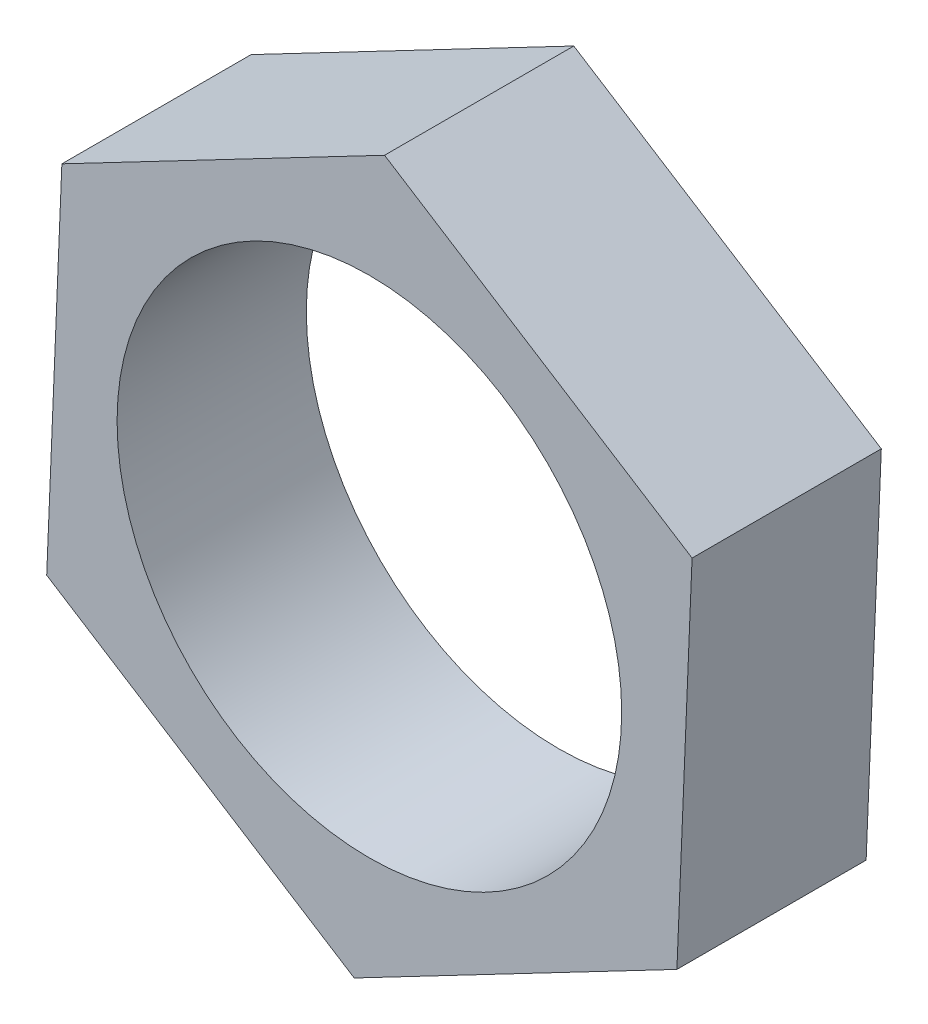
ISO-10303-21;
HEADER;
FILE_DESCRIPTION(('STEP AP214'),'2;1');
FILE_NAME('part.step','',(''),(''),'','','');
FILE_SCHEMA(('AUTOMOTIVE_DESIGN { 1 0 10303 214 1 1 1 1 }'));
ENDSEC;
DATA;
#1=APPLICATION_CONTEXT('core data for automotive mechanical design processes');
#2=APPLICATION_PROTOCOL_DEFINITION('international standard','automotive_design',2000,#1);
#3=PRODUCT_CONTEXT('',#1,'mechanical');
#4=PRODUCT('Part','Part','',(#3));
#5=PRODUCT_RELATED_PRODUCT_CATEGORY('part','',(#4));
#6=PRODUCT_DEFINITION_FORMATION('','',#4);
#7=PRODUCT_DEFINITION_CONTEXT('part definition',#1,'design');
#8=PRODUCT_DEFINITION('design','',#6,#7);
#9=PRODUCT_DEFINITION_SHAPE('','',#8);
#10=(LENGTH_UNIT() NAMED_UNIT(*) SI_UNIT(.MILLI.,.METRE.));
#11=(NAMED_UNIT(*) PLANE_ANGLE_UNIT() SI_UNIT($,.RADIAN.));
#12=(NAMED_UNIT(*) SI_UNIT($,.STERADIAN.) SOLID_ANGLE_UNIT());
#13=UNCERTAINTY_MEASURE_WITH_UNIT(LENGTH_MEASURE(1.E-05),#10,'distance_accuracy_value','');
#14=(GEOMETRIC_REPRESENTATION_CONTEXT(3) GLOBAL_UNCERTAINTY_ASSIGNED_CONTEXT((#13)) GLOBAL_UNIT_ASSIGNED_CONTEXT((#10,
#11,#12)) REPRESENTATION_CONTEXT('',''));
#15=CARTESIAN_POINT('',(0.,0.,0.));
#16=DIRECTION('',(0.,0.,1.));
#17=DIRECTION('',(1.,0.,0.));
#18=AXIS2_PLACEMENT_3D('',#15,#16,#17);
#19=CARTESIAN_POINT('',(-0.240572618673201,-5.76848837638406,3.));
#20=DIRECTION('',(-0.463479854737405,0.886107456380203,0.));
#21=DIRECTION('',(-0.886107456380204,-0.463479854737405,0.));
#22=AXIS2_PLACEMENT_3D('',#19,#20,#21);
#23=PLANE('',#22);
#24=DIRECTION('',(0.886107456380204,0.463479854737405,0.));
#25=VECTOR('',#24,1.);
#26=CARTESIAN_POINT('',(-0.240572618673201,-5.76848837638406,0.));
#27=LINE('',#26,#25);
#28=CARTESIAN_POINT('',(-0.240572618673201,-5.76848837638406,0.));
#29=VERTEX_POINT('',#28);
#30=CARTESIAN_POINT('',(4.87537116604725,-3.09258618741797,0.));
#31=VERTEX_POINT('',#30);
#32=EDGE_CURVE('E133',#29,#31,#27,.T.);
#33=ORIENTED_EDGE('',*,*,#32,.T.);
#34=DIRECTION('',(0.,0.,-1.));
#35=VECTOR('',#34,1.);
#36=CARTESIAN_POINT('',(4.87537116604725,-3.09258618741797,3.));
#37=LINE('',#36,#35);
#38=CARTESIAN_POINT('',(4.87537116604725,-3.09258618741797,3.));
#39=VERTEX_POINT('',#38);
#40=EDGE_CURVE('E11',#39,#31,#37,.T.);
#41=ORIENTED_EDGE('',*,*,#40,.F.);
#42=DIRECTION('',(0.886107456380204,0.463479854737405,0.));
#43=VECTOR('',#42,1.);
#44=CARTESIAN_POINT('',(-0.240572618673201,-5.76848837638406,3.));
#45=LINE('',#44,#43);
#46=CARTESIAN_POINT('',(-0.240572618673201,-5.76848837638406,3.));
#47=VERTEX_POINT('',#46);
#48=EDGE_CURVE('E143',#47,#39,#45,.T.);
#49=ORIENTED_EDGE('',*,*,#48,.F.);
#50=DIRECTION('',(0.,0.,-1.));
#51=VECTOR('',#50,1.);
#52=CARTESIAN_POINT('',(-0.240572618673201,-5.76848837638406,3.));
#53=LINE('',#52,#51);
#54=EDGE_CURVE('E120',#47,#29,#53,.T.);
#55=ORIENTED_EDGE('',*,*,#54,.T.);
#56=EDGE_LOOP('',(#33,#41,#49,#55));
#57=FACE_BOUND('',#56,.T.);
#58=ADVANCED_FACE('F39',(#57),#23,.F.);
#59=CARTESIAN_POINT('',(4.87537116604725,-3.09258618741797,3.));
#60=DIRECTION('',(-0.99913149507677,0.0416683998451879,0.));
#61=DIRECTION('',(-0.0416683998451879,-0.99913149507677,0.));
#62=AXIS2_PLACEMENT_3D('',#59,#60,#61);
#63=PLANE('',#62);
#64=DIRECTION('',(0.0416683998451879,0.99913149507677,0.));
#65=VECTOR('',#64,1.);
#66=CARTESIAN_POINT('',(4.87537116604725,-3.09258618741797,0.));
#67=LINE('',#66,#65);
#68=CARTESIAN_POINT('',(5.11594378472045,2.67590218896609,0.));
#69=VERTEX_POINT('',#68);
#70=EDGE_CURVE('E129',#31,#69,#67,.T.);
#71=ORIENTED_EDGE('',*,*,#70,.T.);
#72=DIRECTION('',(0.,0.,-1.));
#73=VECTOR('',#72,1.);
#74=CARTESIAN_POINT('',(5.11594378472045,2.67590218896609,3.));
#75=LINE('',#74,#73);
#76=CARTESIAN_POINT('',(5.11594378472045,2.67590218896609,3.));
#77=VERTEX_POINT('',#76);
#78=EDGE_CURVE('E47',#77,#69,#75,.T.);
#79=ORIENTED_EDGE('',*,*,#78,.F.);
#80=DIRECTION('',(0.0416683998451879,0.99913149507677,0.));
#81=VECTOR('',#80,1.);
#82=CARTESIAN_POINT('',(4.87537116604725,-3.09258618741797,3.));
#83=LINE('',#82,#81);
#84=EDGE_CURVE('E88',#39,#77,#83,.T.);
#85=ORIENTED_EDGE('',*,*,#84,.F.);
#86=ORIENTED_EDGE('',*,*,#40,.T.);
#87=EDGE_LOOP('',(#71,#79,#85,#86));
#88=FACE_BOUND('',#87,.T.);
#89=ADVANCED_FACE('F130',(#88),#63,.F.);
#90=CARTESIAN_POINT('',(5.11594378472045,2.67590218896609,3.));
#91=DIRECTION('',(-0.535651640339365,-0.844439056535016,0.));
#92=DIRECTION('',(0.844439056535016,-0.535651640339365,0.));
#93=AXIS2_PLACEMENT_3D('',#90,#91,#92);
#94=PLANE('',#93);
#95=DIRECTION('',(-0.844439056535016,0.535651640339365,0.));
#96=VECTOR('',#95,1.);
#97=CARTESIAN_POINT('',(5.11594378472045,2.67590218896609,0.));
#98=LINE('',#97,#96);
#99=CARTESIAN_POINT('',(0.240572618673201,5.76848837638406,0.));
#100=VERTEX_POINT('',#99);
#101=EDGE_CURVE('E128',#69,#100,#98,.T.);
#102=ORIENTED_EDGE('',*,*,#101,.T.);
#103=DIRECTION('',(0.,0.,-1.));
#104=VECTOR('',#103,1.);
#105=CARTESIAN_POINT('',(0.240572618673201,5.76848837638406,3.));
#106=LINE('',#105,#104);
#107=CARTESIAN_POINT('',(0.240572618673201,5.76848837638406,3.));
#108=VERTEX_POINT('',#107);
#109=EDGE_CURVE('E117',#108,#100,#106,.T.);
#110=ORIENTED_EDGE('',*,*,#109,.F.);
#111=DIRECTION('',(-0.844439056535016,0.535651640339365,0.));
#112=VECTOR('',#111,1.);
#113=CARTESIAN_POINT('',(5.11594378472045,2.67590218896609,3.));
#114=LINE('',#113,#112);
#115=EDGE_CURVE('E110',#77,#108,#114,.T.);
#116=ORIENTED_EDGE('',*,*,#115,.F.);
#117=ORIENTED_EDGE('',*,*,#78,.T.);
#118=EDGE_LOOP('',(#102,#110,#116,#117));
#119=FACE_BOUND('',#118,.T.);
#120=ADVANCED_FACE('F127',(#119),#94,.F.);
#121=CARTESIAN_POINT('',(0.240572618673201,5.76848837638406,3.));
#122=DIRECTION('',(0.463479854737405,-0.886107456380203,0.));
#123=DIRECTION('',(0.886107456380204,0.463479854737405,0.));
#124=AXIS2_PLACEMENT_3D('',#121,#122,#123);
#125=PLANE('',#124);
#126=DIRECTION('',(-0.886107456380204,-0.463479854737405,0.));
#127=VECTOR('',#126,1.);
#128=CARTESIAN_POINT('',(0.240572618673201,5.76848837638406,0.));
#129=LINE('',#128,#127);
#130=CARTESIAN_POINT('',(-4.87537116604725,3.09258618741797,0.));
#131=VERTEX_POINT('',#130);
#132=EDGE_CURVE('E116',#100,#131,#129,.T.);
#133=ORIENTED_EDGE('',*,*,#132,.T.);
#134=DIRECTION('',(0.,0.,-1.));
#135=VECTOR('',#134,1.);
#136=CARTESIAN_POINT('',(-4.87537116604725,3.09258618741797,3.));
#137=LINE('',#136,#135);
#138=CARTESIAN_POINT('',(-4.87537116604725,3.09258618741797,3.));
#139=VERTEX_POINT('',#138);
#140=EDGE_CURVE('E103',#139,#131,#137,.T.);
#141=ORIENTED_EDGE('',*,*,#140,.F.);
#142=DIRECTION('',(-0.886107456380204,-0.463479854737405,0.));
#143=VECTOR('',#142,1.);
#144=CARTESIAN_POINT('',(0.240572618673201,5.76848837638406,3.));
#145=LINE('',#144,#143);
#146=EDGE_CURVE('E106',#108,#139,#145,.T.);
#147=ORIENTED_EDGE('',*,*,#146,.F.);
#148=ORIENTED_EDGE('',*,*,#109,.T.);
#149=EDGE_LOOP('',(#133,#141,#147,#148));
#150=FACE_BOUND('',#149,.T.);
#151=ADVANCED_FACE('F115',(#150),#125,.F.);
#152=CARTESIAN_POINT('',(-4.87537116604725,3.09258618741797,3.));
#153=DIRECTION('',(0.99913149507677,-0.0416683998451877,0.));
#154=DIRECTION('',(0.0416683998451877,0.99913149507677,0.));
#155=AXIS2_PLACEMENT_3D('',#152,#153,#154);
#156=PLANE('',#155);
#157=DIRECTION('',(-0.0416683998451877,-0.99913149507677,0.));
#158=VECTOR('',#157,1.);
#159=CARTESIAN_POINT('',(-4.87537116604725,3.09258618741797,0.));
#160=LINE('',#159,#158);
#161=CARTESIAN_POINT('',(-5.11594378472045,-2.67590218896609,0.));
#162=VERTEX_POINT('',#161);
#163=EDGE_CURVE('E141',#131,#162,#160,.T.);
#164=ORIENTED_EDGE('',*,*,#163,.T.);
#165=DIRECTION('',(0.,0.,-1.));
#166=VECTOR('',#165,1.);
#167=CARTESIAN_POINT('',(-5.11594378472045,-2.67590218896609,3.));
#168=LINE('',#167,#166);
#169=CARTESIAN_POINT('',(-5.11594378472045,-2.67590218896609,3.));
#170=VERTEX_POINT('',#169);
#171=EDGE_CURVE('E105',#170,#162,#168,.T.);
#172=ORIENTED_EDGE('',*,*,#171,.F.);
#173=DIRECTION('',(-0.0416683998451877,-0.99913149507677,0.));
#174=VECTOR('',#173,1.);
#175=CARTESIAN_POINT('',(-4.87537116604725,3.09258618741797,3.));
#176=LINE('',#175,#174);
#177=EDGE_CURVE('E98',#139,#170,#176,.T.);
#178=ORIENTED_EDGE('',*,*,#177,.F.);
#179=ORIENTED_EDGE('',*,*,#140,.T.);
#180=EDGE_LOOP('',(#164,#172,#178,#179));
#181=FACE_BOUND('',#180,.T.);
#182=ADVANCED_FACE('F101',(#181),#156,.F.);
#183=CARTESIAN_POINT('',(-5.11594378472045,-2.67590218896609,3.));
#184=DIRECTION('',(0.535651640339365,0.844439056535015,0.));
#185=DIRECTION('',(-0.844439056535016,0.535651640339365,0.));
#186=AXIS2_PLACEMENT_3D('',#183,#184,#185);
#187=PLANE('',#186);
#188=DIRECTION('',(0.844439056535016,-0.535651640339365,0.));
#189=VECTOR('',#188,1.);
#190=CARTESIAN_POINT('',(-5.11594378472045,-2.67590218896609,0.));
#191=LINE('',#190,#189);
#192=EDGE_CURVE('E77',#162,#29,#191,.T.);
#193=ORIENTED_EDGE('',*,*,#192,.T.);
#194=ORIENTED_EDGE('',*,*,#54,.F.);
#195=DIRECTION('',(0.844439056535016,-0.535651640339365,0.));
#196=VECTOR('',#195,1.);
#197=CARTESIAN_POINT('',(-5.11594378472045,-2.67590218896609,3.));
#198=LINE('',#197,#196);
#199=EDGE_CURVE('E55',#170,#47,#198,.T.);
#200=ORIENTED_EDGE('',*,*,#199,.F.);
#201=ORIENTED_EDGE('',*,*,#171,.T.);
#202=EDGE_LOOP('',(#193,#194,#200,#201));
#203=FACE_BOUND('',#202,.T.);
#204=ADVANCED_FACE('F165',(#203),#187,.F.);
#205=CARTESIAN_POINT('',(0.,0.,3.));
#206=DIRECTION('',(0.,0.,1.));
#207=DIRECTION('',(1.,0.,0.));
#208=AXIS2_PLACEMENT_3D('',#205,#206,#207);
#209=PLANE('',#208);
#210=CARTESIAN_POINT('',(0.,0.,3.));
#211=DIRECTION('',(0.,0.,1.));
#212=DIRECTION('',(1.,0.,0.));
#213=AXIS2_PLACEMENT_3D('',#210,#211,#212);
#214=CIRCLE('',#213,4.);
#215=CARTESIAN_POINT('',(4.,0.,3.));
#216=VERTEX_POINT('',#215);
#217=EDGE_CURVE('E150',#216,#216,#214,.T.);
#218=ORIENTED_EDGE('',*,*,#217,.F.);
#219=EDGE_LOOP('',(#218));
#220=FACE_BOUND('',#219,.T.);
#221=ORIENTED_EDGE('',*,*,#48,.T.);
#222=ORIENTED_EDGE('',*,*,#84,.T.);
#223=ORIENTED_EDGE('',*,*,#115,.T.);
#224=ORIENTED_EDGE('',*,*,#146,.T.);
#225=ORIENTED_EDGE('',*,*,#177,.T.);
#226=ORIENTED_EDGE('',*,*,#199,.T.);
#227=EDGE_LOOP('',(#221,#222,#223,#224,#225,#226));
#228=FACE_BOUND('',#227,.T.);
#229=ADVANCED_FACE('F109',(#220,#228),#209,.T.);
#230=CARTESIAN_POINT('',(0.,0.,0.));
#231=DIRECTION('',(0.,0.,1.));
#232=DIRECTION('',(1.,0.,0.));
#233=AXIS2_PLACEMENT_3D('',#230,#231,#232);
#234=PLANE('',#233);
#235=CARTESIAN_POINT('',(0.,0.,0.));
#236=DIRECTION('',(0.,0.,1.));
#237=DIRECTION('',(1.,0.,0.));
#238=AXIS2_PLACEMENT_3D('',#235,#236,#237);
#239=CIRCLE('',#238,4.);
#240=CARTESIAN_POINT('',(4.,0.,0.));
#241=VERTEX_POINT('',#240);
#242=EDGE_CURVE('E136',#241,#241,#239,.T.);
#243=ORIENTED_EDGE('',*,*,#242,.T.);
#244=EDGE_LOOP('',(#243));
#245=FACE_BOUND('',#244,.T.);
#246=ORIENTED_EDGE('',*,*,#32,.F.);
#247=ORIENTED_EDGE('',*,*,#192,.F.);
#248=ORIENTED_EDGE('',*,*,#163,.F.);
#249=ORIENTED_EDGE('',*,*,#132,.F.);
#250=ORIENTED_EDGE('',*,*,#101,.F.);
#251=ORIENTED_EDGE('',*,*,#70,.F.);
#252=EDGE_LOOP('',(#246,#247,#248,#249,#250,#251));
#253=FACE_BOUND('',#252,.T.);
#254=ADVANCED_FACE('F156',(#245,#253),#234,.F.);
#255=CARTESIAN_POINT('',(0.,0.,0.));
#256=DIRECTION('',(0.,0.,1.));
#257=DIRECTION('',(1.,0.,0.));
#258=AXIS2_PLACEMENT_3D('',#255,#256,#257);
#259=CYLINDRICAL_SURFACE('',#258,4.);
#260=ORIENTED_EDGE('',*,*,#242,.F.);
#261=EDGE_LOOP('',(#260));
#262=FACE_BOUND('',#261,.T.);
#263=ORIENTED_EDGE('',*,*,#217,.T.);
#264=EDGE_LOOP('',(#263));
#265=FACE_BOUND('',#264,.T.);
#266=ADVANCED_FACE('F158',(#262,#265),#259,.F.);
#267=CLOSED_SHELL('',(#58,#89,#120,#151,#182,#204,#229,#254,#266));
#268=MANIFOLD_SOLID_BREP('B2',#267);
#269=ADVANCED_BREP_SHAPE_REPRESENTATION('',(#18,#268),#14);
#270=SHAPE_DEFINITION_REPRESENTATION(#9,#269);
ENDSEC;
END-ISO-10303-21;
